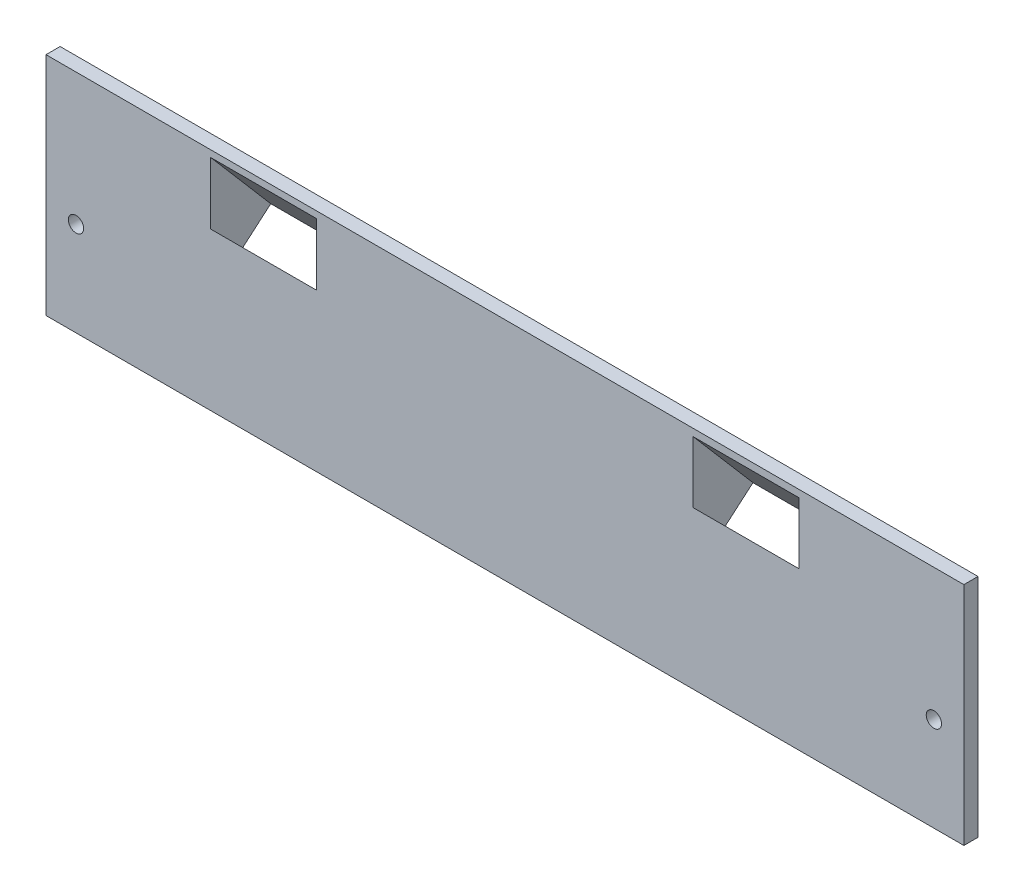
ISO-10303-21;
HEADER;
FILE_DESCRIPTION(('STEP AP214'),'2;1');
FILE_NAME('part.step','',(''),(''),'','','');
FILE_SCHEMA(('AUTOMOTIVE_DESIGN { 1 0 10303 214 1 1 1 1 }'));
ENDSEC;
DATA;
#1=APPLICATION_CONTEXT('core data for automotive mechanical design processes');
#2=APPLICATION_PROTOCOL_DEFINITION('international standard','automotive_design',2000,#1);
#3=PRODUCT_CONTEXT('',#1,'mechanical');
#4=PRODUCT('Part','Part','',(#3));
#5=PRODUCT_RELATED_PRODUCT_CATEGORY('part','',(#4));
#6=PRODUCT_DEFINITION_FORMATION('','',#4);
#7=PRODUCT_DEFINITION_CONTEXT('part definition',#1,'design');
#8=PRODUCT_DEFINITION('design','',#6,#7);
#9=PRODUCT_DEFINITION_SHAPE('','',#8);
#10=(LENGTH_UNIT() NAMED_UNIT(*) SI_UNIT(.MILLI.,.METRE.));
#11=(NAMED_UNIT(*) PLANE_ANGLE_UNIT() SI_UNIT($,.RADIAN.));
#12=(NAMED_UNIT(*) SI_UNIT($,.STERADIAN.) SOLID_ANGLE_UNIT());
#13=UNCERTAINTY_MEASURE_WITH_UNIT(LENGTH_MEASURE(1.E-05),#10,'distance_accuracy_value','');
#14=(GEOMETRIC_REPRESENTATION_CONTEXT(3) GLOBAL_UNCERTAINTY_ASSIGNED_CONTEXT((#13)) GLOBAL_UNIT_ASSIGNED_CONTEXT((#10,
#11,#12)) REPRESENTATION_CONTEXT('',''));
#15=CARTESIAN_POINT('',(0.,0.,0.));
#16=DIRECTION('',(0.,0.,1.));
#17=DIRECTION('',(1.,0.,0.));
#18=AXIS2_PLACEMENT_3D('',#15,#16,#17);
#19=CARTESIAN_POINT('',(0.,0.,0.));
#20=DIRECTION('',(0.,0.,1.));
#21=DIRECTION('',(1.,0.,0.));
#22=AXIS2_PLACEMENT_3D('',#19,#20,#21);
#23=PLANE('',#22);
#24=DIRECTION('',(0.,1.,0.));
#25=VECTOR('',#24,1.);
#26=CARTESIAN_POINT('',(-72.5,39.4998399420699,0.));
#27=LINE('',#26,#25);
#28=CARTESIAN_POINT('',(-72.5,21.0602649226162,0.));
#29=VERTEX_POINT('',#28);
#30=CARTESIAN_POINT('',(-72.5,39.4998399420699,0.));
#31=VERTEX_POINT('',#30);
#32=EDGE_CURVE('E270',#29,#31,#27,.T.);
#33=ORIENTED_EDGE('',*,*,#32,.F.);
#34=DIRECTION('',(-1.,0.,0.));
#35=VECTOR('',#34,1.);
#36=CARTESIAN_POINT('',(-37.5,21.0602649226161,0.));
#37=LINE('',#36,#35);
#38=CARTESIAN_POINT('',(-37.5,21.0602649226161,0.));
#39=VERTEX_POINT('',#38);
#40=EDGE_CURVE('E244',#39,#29,#37,.T.);
#41=ORIENTED_EDGE('',*,*,#40,.F.);
#42=DIRECTION('',(0.,1.,0.));
#43=VECTOR('',#42,1.);
#44=CARTESIAN_POINT('',(-37.5,39.4998399420699,0.));
#45=LINE('',#44,#43);
#46=CARTESIAN_POINT('',(-37.5,39.4998399420699,0.));
#47=VERTEX_POINT('',#46);
#48=EDGE_CURVE('E271',#39,#47,#45,.T.);
#49=ORIENTED_EDGE('',*,*,#48,.T.);
#50=DIRECTION('',(-1.,0.,0.));
#51=VECTOR('',#50,1.);
#52=CARTESIAN_POINT('',(-37.5,39.4998399420699,0.));
#53=LINE('',#52,#51);
#54=EDGE_CURVE('E276',#47,#31,#53,.T.);
#55=ORIENTED_EDGE('',*,*,#54,.T.);
#56=EDGE_LOOP('',(#33,#41,#49,#55));
#57=FACE_BOUND('',#56,.T.);
#58=CARTESIAN_POINT('',(-91.125,15.,0.));
#59=DIRECTION('',(0.,0.,1.));
#60=DIRECTION('',(-1.,0.,0.));
#61=AXIS2_PLACEMENT_3D('',#58,#59,#60);
#62=CIRCLE('',#61,1.625);
#63=CARTESIAN_POINT('',(-92.75,15.,0.));
#64=VERTEX_POINT('',#63);
#65=EDGE_CURVE('E328',#64,#64,#62,.T.);
#66=ORIENTED_EDGE('',*,*,#65,.T.);
#67=EDGE_LOOP('',(#66));
#68=FACE_BOUND('',#67,.T.);
#69=CARTESIAN_POINT('',(91.125,15.,0.));
#70=DIRECTION('',(0.,0.,1.));
#71=DIRECTION('',(1.,0.,0.));
#72=AXIS2_PLACEMENT_3D('',#69,#70,#71);
#73=CIRCLE('',#72,1.625);
#74=CARTESIAN_POINT('',(92.75,15.,0.));
#75=VERTEX_POINT('',#74);
#76=EDGE_CURVE('E332',#75,#75,#73,.T.);
#77=ORIENTED_EDGE('',*,*,#76,.T.);
#78=EDGE_LOOP('',(#77));
#79=FACE_BOUND('',#78,.T.);
#80=DIRECTION('',(0.,1.,0.));
#81=VECTOR('',#80,1.);
#82=CARTESIAN_POINT('',(97.5,0.,0.));
#83=LINE('',#82,#81);
#84=CARTESIAN_POINT('',(97.5,-5.,0.));
#85=VERTEX_POINT('',#84);
#86=CARTESIAN_POINT('',(97.5,43.,0.));
#87=VERTEX_POINT('',#86);
#88=EDGE_CURVE('E338',#85,#87,#83,.T.);
#89=ORIENTED_EDGE('',*,*,#88,.F.);
#90=DIRECTION('',(1.,0.,0.));
#91=VECTOR('',#90,1.);
#92=CARTESIAN_POINT('',(-97.5,-5.,0.));
#93=LINE('',#92,#91);
#94=CARTESIAN_POINT('',(-97.5,-5.,0.));
#95=VERTEX_POINT('',#94);
#96=EDGE_CURVE('E319',#95,#85,#93,.T.);
#97=ORIENTED_EDGE('',*,*,#96,.F.);
#98=DIRECTION('',(0.,-1.,0.));
#99=VECTOR('',#98,1.);
#100=CARTESIAN_POINT('',(-97.5,0.,0.));
#101=LINE('',#100,#99);
#102=CARTESIAN_POINT('',(-97.5,43.,0.));
#103=VERTEX_POINT('',#102);
#104=EDGE_CURVE('E38',#103,#95,#101,.T.);
#105=ORIENTED_EDGE('',*,*,#104,.F.);
#106=DIRECTION('',(-1.,0.,0.));
#107=VECTOR('',#106,1.);
#108=CARTESIAN_POINT('',(-97.5,43.,0.));
#109=LINE('',#108,#107);
#110=EDGE_CURVE('E313',#87,#103,#109,.T.);
#111=ORIENTED_EDGE('',*,*,#110,.F.);
#112=EDGE_LOOP('',(#89,#97,#105,#111));
#113=FACE_BOUND('',#112,.T.);
#114=DIRECTION('',(0.,-1.,0.));
#115=VECTOR('',#114,1.);
#116=CARTESIAN_POINT('',(37.5,39.4998399420699,0.));
#117=LINE('',#116,#115);
#118=CARTESIAN_POINT('',(37.5,39.4998399420699,0.));
#119=VERTEX_POINT('',#118);
#120=CARTESIAN_POINT('',(37.5,21.0602649226161,0.));
#121=VERTEX_POINT('',#120);
#122=EDGE_CURVE('E51',#119,#121,#117,.T.);
#123=ORIENTED_EDGE('',*,*,#122,.T.);
#124=DIRECTION('',(-1.,0.,0.));
#125=VECTOR('',#124,1.);
#126=CARTESIAN_POINT('',(72.5,21.0602649226161,0.));
#127=LINE('',#126,#125);
#128=CARTESIAN_POINT('',(72.5,21.0602649226161,0.));
#129=VERTEX_POINT('',#128);
#130=EDGE_CURVE('E209',#129,#121,#127,.T.);
#131=ORIENTED_EDGE('',*,*,#130,.F.);
#132=DIRECTION('',(0.,-1.,0.));
#133=VECTOR('',#132,1.);
#134=CARTESIAN_POINT('',(72.5,39.4998399420699,0.));
#135=LINE('',#134,#133);
#136=CARTESIAN_POINT('',(72.5,39.4998399420699,0.));
#137=VERTEX_POINT('',#136);
#138=EDGE_CURVE('E59',#137,#129,#135,.T.);
#139=ORIENTED_EDGE('',*,*,#138,.F.);
#140=DIRECTION('',(1.,0.,0.));
#141=VECTOR('',#140,1.);
#142=CARTESIAN_POINT('',(37.5,39.4998399420699,0.));
#143=LINE('',#142,#141);
#144=EDGE_CURVE('E299',#119,#137,#143,.T.);
#145=ORIENTED_EDGE('',*,*,#144,.F.);
#146=EDGE_LOOP('',(#123,#131,#139,#145));
#147=FACE_BOUND('',#146,.T.);
#148=ADVANCED_FACE('F34',(#57,#68,#79,#113,#147),#23,.F.);
#149=CARTESIAN_POINT('',(0.,0.,3.));
#150=DIRECTION('',(0.,0.,1.));
#151=DIRECTION('',(1.,0.,0.));
#152=AXIS2_PLACEMENT_3D('',#149,#150,#151);
#153=PLANE('',#152);
#154=DIRECTION('',(0.,1.,0.));
#155=VECTOR('',#154,1.);
#156=CARTESIAN_POINT('',(-40.,0.,3.));
#157=LINE('',#156,#155);
#158=CARTESIAN_POINT('',(-40.,28.402003109599,3.));
#159=VERTEX_POINT('',#158);
#160=CARTESIAN_POINT('',(-40.,41.5744273875817,3.));
#161=VERTEX_POINT('',#160);
#162=EDGE_CURVE('E268',#159,#161,#157,.T.);
#163=ORIENTED_EDGE('',*,*,#162,.F.);
#164=DIRECTION('',(1.,0.,0.));
#165=VECTOR('',#164,1.);
#166=CARTESIAN_POINT('',(0.,28.402003109599,3.));
#167=LINE('',#166,#165);
#168=CARTESIAN_POINT('',(-62.5,28.402003109599,3.));
#169=VERTEX_POINT('',#168);
#170=EDGE_CURVE('E256',#169,#159,#167,.T.);
#171=ORIENTED_EDGE('',*,*,#170,.F.);
#172=DIRECTION('',(0.,-1.,0.));
#173=VECTOR('',#172,1.);
#174=CARTESIAN_POINT('',(-62.5,0.,3.));
#175=LINE('',#174,#173);
#176=CARTESIAN_POINT('',(-62.5,41.5744273875817,3.));
#177=VERTEX_POINT('',#176);
#178=EDGE_CURVE('E263',#177,#169,#175,.T.);
#179=ORIENTED_EDGE('',*,*,#178,.F.);
#180=DIRECTION('',(-1.,0.,0.));
#181=VECTOR('',#180,1.);
#182=CARTESIAN_POINT('',(0.,41.5744273875817,3.));
#183=LINE('',#182,#181);
#184=EDGE_CURVE('E266',#161,#177,#183,.T.);
#185=ORIENTED_EDGE('',*,*,#184,.F.);
#186=EDGE_LOOP('',(#163,#171,#179,#185));
#187=FACE_BOUND('',#186,.T.);
#188=DIRECTION('',(0.,-1.,0.));
#189=VECTOR('',#188,1.);
#190=CARTESIAN_POINT('',(40.,0.,3.));
#191=LINE('',#190,#189);
#192=CARTESIAN_POINT('',(40.,41.4633687483788,3.));
#193=VERTEX_POINT('',#192);
#194=CARTESIAN_POINT('',(40.,28.4020031095991,3.));
#195=VERTEX_POINT('',#194);
#196=EDGE_CURVE('E293',#193,#195,#191,.T.);
#197=ORIENTED_EDGE('',*,*,#196,.F.);
#198=DIRECTION('',(-1.,0.,0.));
#199=VECTOR('',#198,1.);
#200=CARTESIAN_POINT('',(0.,41.4633687483788,3.));
#201=LINE('',#200,#199);
#202=CARTESIAN_POINT('',(62.5,41.4633687483788,3.));
#203=VERTEX_POINT('',#202);
#204=EDGE_CURVE('E180',#203,#193,#201,.T.);
#205=ORIENTED_EDGE('',*,*,#204,.F.);
#206=DIRECTION('',(0.,1.,0.));
#207=VECTOR('',#206,1.);
#208=CARTESIAN_POINT('',(62.5,0.,3.));
#209=LINE('',#208,#207);
#210=CARTESIAN_POINT('',(62.5,28.4020031095991,3.));
#211=VERTEX_POINT('',#210);
#212=EDGE_CURVE('E288',#211,#203,#209,.T.);
#213=ORIENTED_EDGE('',*,*,#212,.F.);
#214=DIRECTION('',(1.,0.,0.));
#215=VECTOR('',#214,1.);
#216=CARTESIAN_POINT('',(0.,28.4020031095991,3.));
#217=LINE('',#216,#215);
#218=EDGE_CURVE('E291',#195,#211,#217,.T.);
#219=ORIENTED_EDGE('',*,*,#218,.F.);
#220=EDGE_LOOP('',(#197,#205,#213,#219));
#221=FACE_BOUND('',#220,.T.);
#222=CARTESIAN_POINT('',(91.125,15.,3.));
#223=DIRECTION('',(0.,0.,1.));
#224=DIRECTION('',(1.,0.,0.));
#225=AXIS2_PLACEMENT_3D('',#222,#223,#224);
#226=CIRCLE('',#225,1.625);
#227=CARTESIAN_POINT('',(92.75,15.,3.));
#228=VERTEX_POINT('',#227);
#229=EDGE_CURVE('E335',#228,#228,#226,.T.);
#230=ORIENTED_EDGE('',*,*,#229,.F.);
#231=EDGE_LOOP('',(#230));
#232=FACE_BOUND('',#231,.T.);
#233=DIRECTION('',(0.,1.,0.));
#234=VECTOR('',#233,1.);
#235=CARTESIAN_POINT('',(97.5,0.,3.));
#236=LINE('',#235,#234);
#237=CARTESIAN_POINT('',(97.5,-5.,3.));
#238=VERTEX_POINT('',#237);
#239=CARTESIAN_POINT('',(97.5,43.,3.));
#240=VERTEX_POINT('',#239);
#241=EDGE_CURVE('E43',#238,#240,#236,.T.);
#242=ORIENTED_EDGE('',*,*,#241,.T.);
#243=DIRECTION('',(1.,0.,0.));
#244=VECTOR('',#243,1.);
#245=CARTESIAN_POINT('',(-97.5,43.,3.));
#246=LINE('',#245,#244);
#247=CARTESIAN_POINT('',(-97.5,43.,3.));
#248=VERTEX_POINT('',#247);
#249=EDGE_CURVE('E307',#248,#240,#246,.T.);
#250=ORIENTED_EDGE('',*,*,#249,.F.);
#251=DIRECTION('',(0.,-1.,0.));
#252=VECTOR('',#251,1.);
#253=CARTESIAN_POINT('',(-97.5,0.,3.));
#254=LINE('',#253,#252);
#255=CARTESIAN_POINT('',(-97.5,-5.,3.));
#256=VERTEX_POINT('',#255);
#257=EDGE_CURVE('E11',#248,#256,#254,.T.);
#258=ORIENTED_EDGE('',*,*,#257,.T.);
#259=DIRECTION('',(-1.,0.,0.));
#260=VECTOR('',#259,1.);
#261=CARTESIAN_POINT('',(-97.5,-5.,3.));
#262=LINE('',#261,#260);
#263=EDGE_CURVE('E325',#238,#256,#262,.T.);
#264=ORIENTED_EDGE('',*,*,#263,.F.);
#265=EDGE_LOOP('',(#242,#250,#258,#264));
#266=FACE_BOUND('',#265,.T.);
#267=CARTESIAN_POINT('',(-91.125,15.,3.));
#268=DIRECTION('',(0.,0.,1.));
#269=DIRECTION('',(-1.,0.,0.));
#270=AXIS2_PLACEMENT_3D('',#267,#268,#269);
#271=CIRCLE('',#270,1.625);
#272=CARTESIAN_POINT('',(-92.75,15.,3.));
#273=VERTEX_POINT('',#272);
#274=EDGE_CURVE('E329',#273,#273,#271,.T.);
#275=ORIENTED_EDGE('',*,*,#274,.F.);
#276=EDGE_LOOP('',(#275));
#277=FACE_BOUND('',#276,.T.);
#278=ADVANCED_FACE('F355',(#187,#221,#232,#266,#277),#153,.T.);
#279=CARTESIAN_POINT('',(97.5,0.,3.));
#280=DIRECTION('',(-1.,0.,0.));
#281=DIRECTION('',(0.,0.,1.));
#282=AXIS2_PLACEMENT_3D('',#279,#280,#281);
#283=PLANE('',#282);
#284=ORIENTED_EDGE('',*,*,#88,.T.);
#285=DIRECTION('',(0.,0.,-1.));
#286=VECTOR('',#285,1.);
#287=CARTESIAN_POINT('',(97.5,43.,0.));
#288=LINE('',#287,#286);
#289=EDGE_CURVE('E310',#240,#87,#288,.T.);
#290=ORIENTED_EDGE('',*,*,#289,.F.);
#291=ORIENTED_EDGE('',*,*,#241,.F.);
#292=DIRECTION('',(0.,0.,1.));
#293=VECTOR('',#292,1.);
#294=CARTESIAN_POINT('',(97.5,-5.,3.));
#295=LINE('',#294,#293);
#296=EDGE_CURVE('E322',#85,#238,#295,.T.);
#297=ORIENTED_EDGE('',*,*,#296,.F.);
#298=EDGE_LOOP('',(#284,#290,#291,#297));
#299=FACE_BOUND('',#298,.T.);
#300=ADVANCED_FACE('F36',(#299),#283,.F.);
#301=CARTESIAN_POINT('',(-97.5,0.,3.));
#302=DIRECTION('',(1.,0.,0.));
#303=DIRECTION('',(0.,0.,-1.));
#304=AXIS2_PLACEMENT_3D('',#301,#302,#303);
#305=PLANE('',#304);
#306=ORIENTED_EDGE('',*,*,#104,.T.);
#307=DIRECTION('',(0.,0.,-1.));
#308=VECTOR('',#307,1.);
#309=CARTESIAN_POINT('',(-97.5,-5.,3.));
#310=LINE('',#309,#308);
#311=EDGE_CURVE('E316',#256,#95,#310,.T.);
#312=ORIENTED_EDGE('',*,*,#311,.F.);
#313=ORIENTED_EDGE('',*,*,#257,.F.);
#314=DIRECTION('',(0.,0.,1.));
#315=VECTOR('',#314,1.);
#316=CARTESIAN_POINT('',(-97.5,43.,0.));
#317=LINE('',#316,#315);
#318=EDGE_CURVE('E304',#103,#248,#317,.T.);
#319=ORIENTED_EDGE('',*,*,#318,.F.);
#320=EDGE_LOOP('',(#306,#312,#313,#319));
#321=FACE_BOUND('',#320,.T.);
#322=ADVANCED_FACE('F348',(#321),#305,.F.);
#323=CARTESIAN_POINT('',(91.125,15.,3.));
#324=DIRECTION('',(0.,0.,-1.));
#325=DIRECTION('',(-1.,0.,0.));
#326=AXIS2_PLACEMENT_3D('',#323,#324,#325);
#327=CYLINDRICAL_SURFACE('',#326,1.625);
#328=ORIENTED_EDGE('',*,*,#229,.T.);
#329=EDGE_LOOP('',(#328));
#330=FACE_BOUND('',#329,.T.);
#331=ORIENTED_EDGE('',*,*,#76,.F.);
#332=EDGE_LOOP('',(#331));
#333=FACE_BOUND('',#332,.T.);
#334=ADVANCED_FACE('F365',(#330,#333),#327,.F.);
#335=CARTESIAN_POINT('',(-91.125,15.,3.));
#336=DIRECTION('',(0.,0.,-1.));
#337=DIRECTION('',(-1.,0.,0.));
#338=AXIS2_PLACEMENT_3D('',#335,#336,#337);
#339=CYLINDRICAL_SURFACE('',#338,1.625);
#340=ORIENTED_EDGE('',*,*,#274,.T.);
#341=EDGE_LOOP('',(#340));
#342=FACE_BOUND('',#341,.T.);
#343=ORIENTED_EDGE('',*,*,#65,.F.);
#344=EDGE_LOOP('',(#343));
#345=FACE_BOUND('',#344,.T.);
#346=ADVANCED_FACE('F377',(#342,#345),#339,.F.);
#347=CARTESIAN_POINT('',(0.,-5.,0.));
#348=DIRECTION('',(0.,-1.,0.));
#349=DIRECTION('',(0.,0.,-1.));
#350=AXIS2_PLACEMENT_3D('',#347,#348,#349);
#351=PLANE('',#350);
#352=ORIENTED_EDGE('',*,*,#311,.T.);
#353=ORIENTED_EDGE('',*,*,#96,.T.);
#354=ORIENTED_EDGE('',*,*,#296,.T.);
#355=ORIENTED_EDGE('',*,*,#263,.T.);
#356=EDGE_LOOP('',(#352,#353,#354,#355));
#357=FACE_BOUND('',#356,.T.);
#358=ADVANCED_FACE('F352',(#357),#351,.T.);
#359=CARTESIAN_POINT('',(0.,43.,0.));
#360=DIRECTION('',(0.,1.,0.));
#361=DIRECTION('',(0.,0.,1.));
#362=AXIS2_PLACEMENT_3D('',#359,#360,#361);
#363=PLANE('',#362);
#364=ORIENTED_EDGE('',*,*,#318,.T.);
#365=ORIENTED_EDGE('',*,*,#249,.T.);
#366=ORIENTED_EDGE('',*,*,#289,.T.);
#367=ORIENTED_EDGE('',*,*,#110,.T.);
#368=EDGE_LOOP('',(#364,#365,#366,#367));
#369=FACE_BOUND('',#368,.T.);
#370=ADVANCED_FACE('F359',(#369),#363,.T.);
#371=CARTESIAN_POINT('',(37.5,39.4998399420699,0.));
#372=DIRECTION('',(0.,0.650774217265853,-0.759271307334879));
#373=DIRECTION('',(0.,0.759271307334879,0.650774217265853));
#374=AXIS2_PLACEMENT_3D('',#371,#372,#373);
#375=PLANE('',#374);
#376=DIRECTION('',(0.,0.759271307334879,0.650774217265853));
#377=VECTOR('',#376,1.);
#378=CARTESIAN_POINT('',(72.5,39.4998399420699,0.));
#379=LINE('',#378,#377);
#380=CARTESIAN_POINT('',(72.5,27.3078663630393,-10.4497851903156));
#381=VERTEX_POINT('',#380);
#382=EDGE_CURVE('E295',#381,#137,#379,.T.);
#383=ORIENTED_EDGE('',*,*,#382,.F.);
#384=DIRECTION('',(1.,0.,0.));
#385=VECTOR('',#384,1.);
#386=CARTESIAN_POINT('',(37.5,27.3078663630393,-10.4497851903156));
#387=LINE('',#386,#385);
#388=CARTESIAN_POINT('',(37.5,27.3078663630393,-10.4497851903156));
#389=VERTEX_POINT('',#388);
#390=EDGE_CURVE('E729',#389,#381,#387,.T.);
#391=ORIENTED_EDGE('',*,*,#390,.F.);
#392=DIRECTION('',(0.,0.759271307334879,0.650774217265853));
#393=VECTOR('',#392,1.);
#394=CARTESIAN_POINT('',(37.5,39.4998399420699,0.));
#395=LINE('',#394,#393);
#396=EDGE_CURVE('E296',#389,#119,#395,.T.);
#397=ORIENTED_EDGE('',*,*,#396,.T.);
#398=ORIENTED_EDGE('',*,*,#144,.T.);
#399=EDGE_LOOP('',(#383,#391,#397,#398));
#400=FACE_BOUND('',#399,.T.);
#401=ADVANCED_FACE('F386',(#400),#375,.T.);
#402=CARTESIAN_POINT('',(37.5,0.,0.));
#403=DIRECTION('',(1.,0.,0.));
#404=DIRECTION('',(0.,0.,-1.));
#405=AXIS2_PLACEMENT_3D('',#402,#403,#404);
#406=PLANE('',#405);
#407=ORIENTED_EDGE('',*,*,#396,.F.);
#408=DIRECTION('',(0.,0.650774217265853,-0.759271307334879));
#409=VECTOR('',#408,1.);
#410=CARTESIAN_POINT('',(37.5,19.4985757558491,-1.33852950229707));
#411=LINE('',#410,#409);
#412=CARTESIAN_POINT('',(37.5,19.4985757558491,-1.33852950229707));
#413=VERTEX_POINT('',#412);
#414=EDGE_CURVE('E204',#413,#389,#411,.T.);
#415=ORIENTED_EDGE('',*,*,#414,.F.);
#416=DIRECTION('',(0.,-0.759271307334879,-0.650774217265853));
#417=VECTOR('',#416,1.);
#418=CARTESIAN_POINT('',(37.5,62.0062466716785,35.0949508634276));
#419=LINE('',#418,#417);
#420=EDGE_CURVE('E212',#121,#413,#419,.T.);
#421=ORIENTED_EDGE('',*,*,#420,.F.);
#422=ORIENTED_EDGE('',*,*,#122,.F.);
#423=EDGE_LOOP('',(#407,#415,#421,#422));
#424=FACE_BOUND('',#423,.T.);
#425=ADVANCED_FACE('F389',(#424),#406,.F.);
#426=CARTESIAN_POINT('',(72.5,0.,0.));
#427=DIRECTION('',(1.,0.,0.));
#428=DIRECTION('',(0.,0.,-1.));
#429=AXIS2_PLACEMENT_3D('',#426,#427,#428);
#430=PLANE('',#429);
#431=ORIENTED_EDGE('',*,*,#138,.T.);
#432=DIRECTION('',(0.,-0.759271307334879,-0.650774217265853));
#433=VECTOR('',#432,1.);
#434=CARTESIAN_POINT('',(72.5,62.0062466716785,35.0949508634276));
#435=LINE('',#434,#433);
#436=CARTESIAN_POINT('',(72.5,19.4985757558491,-1.33852950229707));
#437=VERTEX_POINT('',#436);
#438=EDGE_CURVE('E195',#129,#437,#435,.T.);
#439=ORIENTED_EDGE('',*,*,#438,.T.);
#440=DIRECTION('',(0.,-0.650774217265853,0.759271307334879));
#441=VECTOR('',#440,1.);
#442=CARTESIAN_POINT('',(72.5,27.3078663630393,-10.4497851903156));
#443=LINE('',#442,#441);
#444=EDGE_CURVE('E725',#381,#437,#443,.T.);
#445=ORIENTED_EDGE('',*,*,#444,.F.);
#446=ORIENTED_EDGE('',*,*,#382,.T.);
#447=EDGE_LOOP('',(#431,#439,#445,#446));
#448=FACE_BOUND('',#447,.T.);
#449=ADVANCED_FACE('F391',(#448),#430,.T.);
#450=CARTESIAN_POINT('',(40.,36.8176449359744,10.2130774196813));
#451=DIRECTION('',(-1.,0.,0.));
#452=DIRECTION('',(0.,0.,1.));
#453=AXIS2_PLACEMENT_3D('',#450,#451,#452);
#454=PLANE('',#453);
#455=DIRECTION('',(0.,-0.75927130733488,-0.650774217265852));
#456=VECTOR('',#455,1.);
#457=CARTESIAN_POINT('',(40.,36.8176449359744,10.2130774196813));
#458=LINE('',#457,#456);
#459=CARTESIAN_POINT('',(40.,21.1255112990137,-3.23670777063428));
#460=VERTEX_POINT('',#459);
#461=EDGE_CURVE('E190',#195,#460,#458,.T.);
#462=ORIENTED_EDGE('',*,*,#461,.T.);
#463=DIRECTION('',(0.,0.650774217265853,-0.759271307334879));
#464=VECTOR('',#463,1.);
#465=CARTESIAN_POINT('',(40.,21.1255112990137,-3.23670777063428));
#466=LINE('',#465,#464);
#467=CARTESIAN_POINT('',(40.,26.6570921457735,-9.69051388298075));
#468=VERTEX_POINT('',#467);
#469=EDGE_CURVE('E187',#460,#468,#466,.T.);
#470=ORIENTED_EDGE('',*,*,#469,.T.);
#471=DIRECTION('',(0.,-0.75927130733488,-0.650774217265852));
#472=VECTOR('',#471,1.);
#473=CARTESIAN_POINT('',(40.,42.3492257827341,3.75927130733487));
#474=LINE('',#473,#472);
#475=EDGE_CURVE('E173',#193,#468,#474,.T.);
#476=ORIENTED_EDGE('',*,*,#475,.F.);
#477=ORIENTED_EDGE('',*,*,#196,.T.);
#478=EDGE_LOOP('',(#462,#470,#476,#477));
#479=FACE_BOUND('',#478,.T.);
#480=ADVANCED_FACE('F188',(#479),#454,.F.);
#481=CARTESIAN_POINT('',(62.5,36.8176449359744,10.2130774196813));
#482=DIRECTION('',(0.,-0.650774217265852,0.75927130733488));
#483=DIRECTION('',(0.,-0.75927130733488,-0.650774217265852));
#484=AXIS2_PLACEMENT_3D('',#481,#482,#483);
#485=PLANE('',#484);
#486=DIRECTION('',(0.,-0.75927130733488,-0.650774217265852));
#487=VECTOR('',#486,1.);
#488=CARTESIAN_POINT('',(62.5,36.8176449359744,10.2130774196813));
#489=LINE('',#488,#487);
#490=CARTESIAN_POINT('',(62.5,21.1255112990137,-3.23670777063428));
#491=VERTEX_POINT('',#490);
#492=EDGE_CURVE('E284',#211,#491,#489,.T.);
#493=ORIENTED_EDGE('',*,*,#492,.T.);
#494=DIRECTION('',(-1.,0.,0.));
#495=VECTOR('',#494,1.);
#496=CARTESIAN_POINT('',(40.,21.1255112990137,-3.23670777063428));
#497=LINE('',#496,#495);
#498=EDGE_CURVE('E194',#491,#460,#497,.T.);
#499=ORIENTED_EDGE('',*,*,#498,.T.);
#500=ORIENTED_EDGE('',*,*,#461,.F.);
#501=ORIENTED_EDGE('',*,*,#218,.T.);
#502=EDGE_LOOP('',(#493,#499,#500,#501));
#503=FACE_BOUND('',#502,.T.);
#504=ADVANCED_FACE('F399',(#503),#485,.F.);
#505=CARTESIAN_POINT('',(62.5,42.3492257827341,3.75927130733487));
#506=DIRECTION('',(1.,0.,0.));
#507=DIRECTION('',(0.,0.,-1.));
#508=AXIS2_PLACEMENT_3D('',#505,#506,#507);
#509=PLANE('',#508);
#510=DIRECTION('',(0.,-0.75927130733488,-0.650774217265852));
#511=VECTOR('',#510,1.);
#512=CARTESIAN_POINT('',(62.5,42.3492257827341,3.75927130733487));
#513=LINE('',#512,#511);
#514=CARTESIAN_POINT('',(62.5,26.6570921457735,-9.69051388298076));
#515=VERTEX_POINT('',#514);
#516=EDGE_CURVE('E183',#203,#515,#513,.T.);
#517=ORIENTED_EDGE('',*,*,#516,.T.);
#518=DIRECTION('',(0.,-0.650774217265853,0.759271307334879));
#519=VECTOR('',#518,1.);
#520=CARTESIAN_POINT('',(62.5,21.1255112990137,-3.23670777063428));
#521=LINE('',#520,#519);
#522=EDGE_CURVE('E200',#515,#491,#521,.T.);
#523=ORIENTED_EDGE('',*,*,#522,.T.);
#524=ORIENTED_EDGE('',*,*,#492,.F.);
#525=ORIENTED_EDGE('',*,*,#212,.T.);
#526=EDGE_LOOP('',(#517,#523,#524,#525));
#527=FACE_BOUND('',#526,.T.);
#528=ADVANCED_FACE('F403',(#527),#509,.F.);
#529=CARTESIAN_POINT('',(40.,42.3492257827341,3.75927130733487));
#530=DIRECTION('',(0.,0.650774217265852,-0.75927130733488));
#531=DIRECTION('',(0.,0.75927130733488,0.650774217265852));
#532=AXIS2_PLACEMENT_3D('',#529,#530,#531);
#533=PLANE('',#532);
#534=ORIENTED_EDGE('',*,*,#475,.T.);
#535=DIRECTION('',(1.,0.,0.));
#536=VECTOR('',#535,1.);
#537=CARTESIAN_POINT('',(40.,26.6570921457735,-9.69051388298076));
#538=LINE('',#537,#536);
#539=EDGE_CURVE('E177',#468,#515,#538,.T.);
#540=ORIENTED_EDGE('',*,*,#539,.T.);
#541=ORIENTED_EDGE('',*,*,#516,.F.);
#542=ORIENTED_EDGE('',*,*,#204,.T.);
#543=EDGE_LOOP('',(#534,#540,#541,#542));
#544=FACE_BOUND('',#543,.T.);
#545=ADVANCED_FACE('F175',(#544),#533,.F.);
#546=CARTESIAN_POINT('',(-37.5,30.3449515923788,-7.84668832125221));
#547=DIRECTION('',(0.,0.650774217265853,-0.759271307334879));
#548=DIRECTION('',(0.,0.759271307334879,0.650774217265853));
#549=AXIS2_PLACEMENT_3D('',#546,#547,#548);
#550=PLANE('',#549);
#551=DIRECTION('',(0.,-0.759271307334879,-0.650774217265853));
#552=VECTOR('',#551,1.);
#553=CARTESIAN_POINT('',(-72.5,30.3449515923788,-7.84668832125221));
#554=LINE('',#553,#552);
#555=CARTESIAN_POINT('',(-72.5,27.3078663630393,-10.4497851903156));
#556=VERTEX_POINT('',#555);
#557=EDGE_CURVE('E274',#31,#556,#554,.T.);
#558=ORIENTED_EDGE('',*,*,#557,.F.);
#559=ORIENTED_EDGE('',*,*,#54,.F.);
#560=DIRECTION('',(0.,-0.759271307334879,-0.650774217265853));
#561=VECTOR('',#560,1.);
#562=CARTESIAN_POINT('',(-37.5,30.3449515923788,-7.84668832125221));
#563=LINE('',#562,#561);
#564=CARTESIAN_POINT('',(-37.5,27.3078663630393,-10.4497851903156));
#565=VERTEX_POINT('',#564);
#566=EDGE_CURVE('E273',#47,#565,#563,.T.);
#567=ORIENTED_EDGE('',*,*,#566,.T.);
#568=DIRECTION('',(1.,0.,0.));
#569=VECTOR('',#568,1.);
#570=CARTESIAN_POINT('',(-72.5,27.3078663630393,-10.4497851903156));
#571=LINE('',#570,#569);
#572=EDGE_CURVE('E222',#556,#565,#571,.T.);
#573=ORIENTED_EDGE('',*,*,#572,.F.);
#574=EDGE_LOOP('',(#558,#559,#567,#573));
#575=FACE_BOUND('',#574,.T.);
#576=ADVANCED_FACE('F402',(#575),#550,.T.);
#577=CARTESIAN_POINT('',(-37.5,0.,0.));
#578=DIRECTION('',(1.,0.,0.));
#579=DIRECTION('',(0.,0.,-1.));
#580=AXIS2_PLACEMENT_3D('',#577,#578,#579);
#581=PLANE('',#580);
#582=ORIENTED_EDGE('',*,*,#48,.F.);
#583=DIRECTION('',(0.,-0.759271307334879,-0.650774217265853));
#584=VECTOR('',#583,1.);
#585=CARTESIAN_POINT('',(-37.5,62.0062466716785,35.0949508634276));
#586=LINE('',#585,#584);
#587=CARTESIAN_POINT('',(-37.5,19.4985757558491,-1.33852950229708));
#588=VERTEX_POINT('',#587);
#589=EDGE_CURVE('E241',#39,#588,#586,.T.);
#590=ORIENTED_EDGE('',*,*,#589,.T.);
#591=DIRECTION('',(0.,-0.650774217265853,0.759271307334879));
#592=VECTOR('',#591,1.);
#593=CARTESIAN_POINT('',(-37.5,27.3078663630393,-10.4497851903156));
#594=LINE('',#593,#592);
#595=EDGE_CURVE('E219',#565,#588,#594,.T.);
#596=ORIENTED_EDGE('',*,*,#595,.F.);
#597=ORIENTED_EDGE('',*,*,#566,.F.);
#598=EDGE_LOOP('',(#582,#590,#596,#597));
#599=FACE_BOUND('',#598,.T.);
#600=ADVANCED_FACE('F420',(#599),#581,.T.);
#601=CARTESIAN_POINT('',(-72.5,0.,0.));
#602=DIRECTION('',(1.,0.,0.));
#603=DIRECTION('',(0.,0.,-1.));
#604=AXIS2_PLACEMENT_3D('',#601,#602,#603);
#605=PLANE('',#604);
#606=ORIENTED_EDGE('',*,*,#32,.T.);
#607=ORIENTED_EDGE('',*,*,#557,.T.);
#608=DIRECTION('',(0.,0.650774217265853,-0.759271307334879));
#609=VECTOR('',#608,1.);
#610=CARTESIAN_POINT('',(-72.5,19.4985757558491,-1.33852950229708));
#611=LINE('',#610,#609);
#612=CARTESIAN_POINT('',(-72.5,19.4985757558491,-1.33852950229708));
#613=VERTEX_POINT('',#612);
#614=EDGE_CURVE('E225',#613,#556,#611,.T.);
#615=ORIENTED_EDGE('',*,*,#614,.F.);
#616=DIRECTION('',(0.,-0.759271307334879,-0.650774217265853));
#617=VECTOR('',#616,1.);
#618=CARTESIAN_POINT('',(-72.5,62.0062466716785,35.0949508634276));
#619=LINE('',#618,#617);
#620=EDGE_CURVE('E247',#29,#613,#619,.T.);
#621=ORIENTED_EDGE('',*,*,#620,.F.);
#622=EDGE_LOOP('',(#606,#607,#615,#621));
#623=FACE_BOUND('',#622,.T.);
#624=ADVANCED_FACE('F422',(#623),#605,.F.);
#625=CARTESIAN_POINT('',(-40.,36.8176449359744,10.2130774196814));
#626=DIRECTION('',(1.,0.,0.));
#627=DIRECTION('',(0.,0.,-1.));
#628=AXIS2_PLACEMENT_3D('',#625,#626,#627);
#629=PLANE('',#628);
#630=DIRECTION('',(0.,-0.759271307334879,-0.650774217265853));
#631=VECTOR('',#630,1.);
#632=CARTESIAN_POINT('',(-40.,42.396259902938,3.70439565770233));
#633=LINE('',#632,#631);
#634=CARTESIAN_POINT('',(-40.,26.7041262659774,-9.74538953261332));
#635=VERTEX_POINT('',#634);
#636=EDGE_CURVE('E254',#161,#635,#633,.T.);
#637=ORIENTED_EDGE('',*,*,#636,.T.);
#638=DIRECTION('',(0.,-0.650774217265853,0.759271307334879));
#639=VECTOR('',#638,1.);
#640=CARTESIAN_POINT('',(-40.,21.1255112990137,-3.23670777063427));
#641=LINE('',#640,#639);
#642=CARTESIAN_POINT('',(-40.,21.1255112990137,-3.23670777063427));
#643=VERTEX_POINT('',#642);
#644=EDGE_CURVE('E232',#635,#643,#641,.T.);
#645=ORIENTED_EDGE('',*,*,#644,.T.);
#646=DIRECTION('',(0.,-0.759271307334879,-0.650774217265853));
#647=VECTOR('',#646,1.);
#648=CARTESIAN_POINT('',(-40.,36.8176449359744,10.2130774196814));
#649=LINE('',#648,#647);
#650=EDGE_CURVE('E253',#159,#643,#649,.T.);
#651=ORIENTED_EDGE('',*,*,#650,.F.);
#652=ORIENTED_EDGE('',*,*,#162,.T.);
#653=EDGE_LOOP('',(#637,#645,#651,#652));
#654=FACE_BOUND('',#653,.T.);
#655=ADVANCED_FACE('F425',(#654),#629,.F.);
#656=CARTESIAN_POINT('',(-40.,42.396259902938,3.70439565770233));
#657=DIRECTION('',(0.,0.650774217265853,-0.759271307334879));
#658=DIRECTION('',(0.,0.759271307334879,0.650774217265853));
#659=AXIS2_PLACEMENT_3D('',#656,#657,#658);
#660=PLANE('',#659);
#661=DIRECTION('',(0.,-0.759271307334879,-0.650774217265853));
#662=VECTOR('',#661,1.);
#663=CARTESIAN_POINT('',(-62.5,42.3962599029381,3.70439565770232));
#664=LINE('',#663,#662);
#665=CARTESIAN_POINT('',(-62.5,26.7041262659774,-9.74538953261332));
#666=VERTEX_POINT('',#665);
#667=EDGE_CURVE('E257',#177,#666,#664,.T.);
#668=ORIENTED_EDGE('',*,*,#667,.T.);
#669=DIRECTION('',(1.,0.,0.));
#670=VECTOR('',#669,1.);
#671=CARTESIAN_POINT('',(-62.5,26.7041262659774,-9.74538953261332));
#672=LINE('',#671,#670);
#673=EDGE_CURVE('E236',#666,#635,#672,.T.);
#674=ORIENTED_EDGE('',*,*,#673,.T.);
#675=ORIENTED_EDGE('',*,*,#636,.F.);
#676=ORIENTED_EDGE('',*,*,#184,.T.);
#677=EDGE_LOOP('',(#668,#674,#675,#676));
#678=FACE_BOUND('',#677,.T.);
#679=ADVANCED_FACE('F432',(#678),#660,.F.);
#680=CARTESIAN_POINT('',(-62.5,36.8176449359744,10.2130774196814));
#681=DIRECTION('',(-1.,0.,0.));
#682=DIRECTION('',(0.,0.,1.));
#683=AXIS2_PLACEMENT_3D('',#680,#681,#682);
#684=PLANE('',#683);
#685=DIRECTION('',(0.,-0.759271307334879,-0.650774217265853));
#686=VECTOR('',#685,1.);
#687=CARTESIAN_POINT('',(-62.5,36.8176449359744,10.2130774196814));
#688=LINE('',#687,#686);
#689=CARTESIAN_POINT('',(-62.5,21.1255112990137,-3.23670777063427));
#690=VERTEX_POINT('',#689);
#691=EDGE_CURVE('E259',#169,#690,#688,.T.);
#692=ORIENTED_EDGE('',*,*,#691,.T.);
#693=DIRECTION('',(0.,0.650774217265853,-0.759271307334879));
#694=VECTOR('',#693,1.);
#695=CARTESIAN_POINT('',(-62.5,21.1255112990137,-3.23670777063427));
#696=LINE('',#695,#694);
#697=EDGE_CURVE('E233',#690,#666,#696,.T.);
#698=ORIENTED_EDGE('',*,*,#697,.T.);
#699=ORIENTED_EDGE('',*,*,#667,.F.);
#700=ORIENTED_EDGE('',*,*,#178,.T.);
#701=EDGE_LOOP('',(#692,#698,#699,#700));
#702=FACE_BOUND('',#701,.T.);
#703=ADVANCED_FACE('F438',(#702),#684,.F.);
#704=CARTESIAN_POINT('',(-40.,36.8176449359744,10.2130774196814));
#705=DIRECTION('',(0.,-0.650774217265853,0.759271307334879));
#706=DIRECTION('',(0.,-0.759271307334879,-0.650774217265853));
#707=AXIS2_PLACEMENT_3D('',#704,#705,#706);
#708=PLANE('',#707);
#709=ORIENTED_EDGE('',*,*,#650,.T.);
#710=DIRECTION('',(-1.,0.,0.));
#711=VECTOR('',#710,1.);
#712=CARTESIAN_POINT('',(-62.5,21.1255112990137,-3.23670777063427));
#713=LINE('',#712,#711);
#714=EDGE_CURVE('E229',#643,#690,#713,.T.);
#715=ORIENTED_EDGE('',*,*,#714,.T.);
#716=ORIENTED_EDGE('',*,*,#691,.F.);
#717=ORIENTED_EDGE('',*,*,#170,.T.);
#718=EDGE_LOOP('',(#709,#715,#716,#717));
#719=FACE_BOUND('',#718,.T.);
#720=ADVANCED_FACE('F434',(#719),#708,.F.);
#721=CARTESIAN_POINT('',(-37.5,62.0062466716785,35.0949508634276));
#722=DIRECTION('',(0.,-0.650774217265853,0.759271307334879));
#723=DIRECTION('',(0.,-0.759271307334879,-0.650774217265853));
#724=AXIS2_PLACEMENT_3D('',#721,#722,#723);
#725=PLANE('',#724);
#726=ORIENTED_EDGE('',*,*,#589,.F.);
#727=ORIENTED_EDGE('',*,*,#40,.T.);
#728=ORIENTED_EDGE('',*,*,#620,.T.);
#729=DIRECTION('',(-1.,0.,0.));
#730=VECTOR('',#729,1.);
#731=CARTESIAN_POINT('',(-37.5,19.4985757558491,-1.33852950229708));
#732=LINE('',#731,#730);
#733=EDGE_CURVE('E215',#588,#613,#732,.T.);
#734=ORIENTED_EDGE('',*,*,#733,.F.);
#735=EDGE_LOOP('',(#726,#727,#728,#734));
#736=FACE_BOUND('',#735,.T.);
#737=ADVANCED_FACE('F437',(#736),#725,.T.);
#738=CARTESIAN_POINT('',(0.,10.5794044153158,9.06764625635921));
#739=DIRECTION('',(0.,-0.759271307334879,-0.650774217265853));
#740=DIRECTION('',(0.,0.650774217265853,-0.759271307334879));
#741=AXIS2_PLACEMENT_3D('',#738,#739,#740);
#742=PLANE('',#741);
#743=CARTESIAN_POINT('',(-66.25,23.7286081680772,-6.27379299997386));
#744=DIRECTION('',(0.,-0.759271307334879,-0.650774217265853));
#745=DIRECTION('',(0.,0.650774217265853,-0.759271307334879));
#746=AXIS2_PLACEMENT_3D('',#743,#744,#745);
#747=CIRCLE('',#746,0.999999999999984);
#748=CARTESIAN_POINT('',(-66.25,24.379382385343,-7.03306430730873));
#749=VERTEX_POINT('',#748);
#750=EDGE_CURVE('E228',#749,#749,#747,.T.);
#751=ORIENTED_EDGE('',*,*,#750,.F.);
#752=EDGE_LOOP('',(#751));
#753=FACE_BOUND('',#752,.T.);
#754=ORIENTED_EDGE('',*,*,#697,.F.);
#755=ORIENTED_EDGE('',*,*,#714,.F.);
#756=ORIENTED_EDGE('',*,*,#644,.F.);
#757=ORIENTED_EDGE('',*,*,#673,.F.);
#758=EDGE_LOOP('',(#754,#755,#756,#757));
#759=FACE_BOUND('',#758,.T.);
#760=ORIENTED_EDGE('',*,*,#614,.T.);
#761=ORIENTED_EDGE('',*,*,#572,.T.);
#762=ORIENTED_EDGE('',*,*,#595,.T.);
#763=ORIENTED_EDGE('',*,*,#733,.T.);
#764=EDGE_LOOP('',(#760,#761,#762,#763));
#765=FACE_BOUND('',#764,.T.);
#766=ADVANCED_FACE('F454',(#753,#759,#765),#742,.T.);
#767=CARTESIAN_POINT('',(-66.25,30.5620499340911,-0.416825044581174));
#768=DIRECTION('',(0.,0.759271307334879,0.650774217265853));
#769=DIRECTION('',(0.,-0.650774217265853,0.759271307334879));
#770=AXIS2_PLACEMENT_3D('',#767,#768,#769);
#771=PLANE('',#770);
#772=CARTESIAN_POINT('',(-66.25,30.5620499340911,-0.416825044581174));
#773=DIRECTION('',(0.,-0.759271307334879,-0.650774217265853));
#774=DIRECTION('',(0.,-0.650774217265853,0.759271307334879));
#775=AXIS2_PLACEMENT_3D('',#772,#773,#774);
#776=CIRCLE('',#775,0.999999999999984);
#777=CARTESIAN_POINT('',(-66.25,29.9112757168252,0.342446262753693));
#778=VERTEX_POINT('',#777);
#779=EDGE_CURVE('E218',#778,#778,#776,.T.);
#780=ORIENTED_EDGE('',*,*,#779,.T.);
#781=EDGE_LOOP('',(#780));
#782=FACE_BOUND('',#781,.T.);
#783=ADVANCED_FACE('F450',(#782),#771,.F.);
#784=CARTESIAN_POINT('',(-66.25,30.5620499340911,-0.416825044581174));
#785=DIRECTION('',(0.,-0.759271307334879,-0.650774217265853));
#786=DIRECTION('',(0.,0.650774217265853,-0.759271307334879));
#787=AXIS2_PLACEMENT_3D('',#784,#785,#786);
#788=CYLINDRICAL_SURFACE('',#787,0.999999999999984);
#789=ORIENTED_EDGE('',*,*,#779,.F.);
#790=EDGE_LOOP('',(#789));
#791=FACE_BOUND('',#790,.T.);
#792=ORIENTED_EDGE('',*,*,#750,.T.);
#793=EDGE_LOOP('',(#792));
#794=FACE_BOUND('',#793,.T.);
#795=ADVANCED_FACE('F446',(#791,#794),#788,.F.);
#796=CARTESIAN_POINT('',(72.5,62.0062466716785,35.0949508634276));
#797=DIRECTION('',(0.,-0.650774217265853,0.759271307334879));
#798=DIRECTION('',(0.,-0.759271307334879,-0.650774217265853));
#799=AXIS2_PLACEMENT_3D('',#796,#797,#798);
#800=PLANE('',#799);
#801=ORIENTED_EDGE('',*,*,#438,.F.);
#802=ORIENTED_EDGE('',*,*,#130,.T.);
#803=ORIENTED_EDGE('',*,*,#420,.T.);
#804=DIRECTION('',(-1.,0.,0.));
#805=VECTOR('',#804,1.);
#806=CARTESIAN_POINT('',(72.5,19.4985757558491,-1.33852950229707));
#807=LINE('',#806,#805);
#808=EDGE_CURVE('E248',#437,#413,#807,.T.);
#809=ORIENTED_EDGE('',*,*,#808,.F.);
#810=EDGE_LOOP('',(#801,#802,#803,#809));
#811=FACE_BOUND('',#810,.T.);
#812=ADVANCED_FACE('F449',(#811),#800,.T.);
#813=CARTESIAN_POINT('',(0.,10.5794044153158,9.06764625635922));
#814=DIRECTION('',(0.,-0.759271307334879,-0.650774217265853));
#815=DIRECTION('',(0.,0.650774217265853,-0.759271307334879));
#816=AXIS2_PLACEMENT_3D('',#813,#814,#815);
#817=PLANE('',#816);
#818=CARTESIAN_POINT('',(66.25,23.7286081680771,-6.2737929999738));
#819=DIRECTION('',(0.,-0.759271307334879,-0.650774217265853));
#820=DIRECTION('',(0.,0.650774217265853,-0.759271307334879));
#821=AXIS2_PLACEMENT_3D('',#818,#819,#820);
#822=CIRCLE('',#821,0.999999999999998);
#823=CARTESIAN_POINT('',(66.25,24.379382385343,-7.03306430730868));
#824=VERTEX_POINT('',#823);
#825=EDGE_CURVE('E201',#824,#824,#822,.T.);
#826=ORIENTED_EDGE('',*,*,#825,.F.);
#827=EDGE_LOOP('',(#826));
#828=FACE_BOUND('',#827,.T.);
#829=ORIENTED_EDGE('',*,*,#469,.F.);
#830=ORIENTED_EDGE('',*,*,#498,.F.);
#831=ORIENTED_EDGE('',*,*,#522,.F.);
#832=ORIENTED_EDGE('',*,*,#539,.F.);
#833=EDGE_LOOP('',(#829,#830,#831,#832));
#834=FACE_BOUND('',#833,.T.);
#835=ORIENTED_EDGE('',*,*,#414,.T.);
#836=ORIENTED_EDGE('',*,*,#390,.T.);
#837=ORIENTED_EDGE('',*,*,#444,.T.);
#838=ORIENTED_EDGE('',*,*,#808,.T.);
#839=EDGE_LOOP('',(#835,#836,#837,#838));
#840=FACE_BOUND('',#839,.T.);
#841=ADVANCED_FACE('F197',(#828,#834,#840),#817,.T.);
#842=CARTESIAN_POINT('',(66.25,30.562049934091,-0.41682504458112));
#843=DIRECTION('',(0.,-0.759271307334879,-0.650774217265853));
#844=DIRECTION('',(0.,0.650774217265853,-0.759271307334879));
#845=AXIS2_PLACEMENT_3D('',#842,#843,#844);
#846=PLANE('',#845);
#847=CARTESIAN_POINT('',(66.25,30.562049934091,-0.41682504458112));
#848=DIRECTION('',(0.,-0.759271307334879,-0.650774217265853));
#849=DIRECTION('',(0.,0.650774217265853,-0.759271307334879));
#850=AXIS2_PLACEMENT_3D('',#847,#848,#849);
#851=CIRCLE('',#850,0.999999999999998);
#852=CARTESIAN_POINT('',(66.25,31.2128241513569,-1.176096351916));
#853=VERTEX_POINT('',#852);
#854=EDGE_CURVE('E184',#853,#853,#851,.T.);
#855=ORIENTED_EDGE('',*,*,#854,.T.);
#856=EDGE_LOOP('',(#855));
#857=FACE_BOUND('',#856,.T.);
#858=ADVANCED_FACE('F413',(#857),#846,.T.);
#859=CARTESIAN_POINT('',(66.25,30.562049934091,-0.41682504458112));
#860=DIRECTION('',(0.,-0.759271307334879,-0.650774217265853));
#861=DIRECTION('',(0.,0.650774217265853,-0.759271307334879));
#862=AXIS2_PLACEMENT_3D('',#859,#860,#861);
#863=CYLINDRICAL_SURFACE('',#862,0.999999999999998);
#864=ORIENTED_EDGE('',*,*,#854,.F.);
#865=EDGE_LOOP('',(#864));
#866=FACE_BOUND('',#865,.T.);
#867=ORIENTED_EDGE('',*,*,#825,.T.);
#868=EDGE_LOOP('',(#867));
#869=FACE_BOUND('',#868,.T.);
#870=ADVANCED_FACE('F410',(#866,#869),#863,.F.);
#871=CLOSED_SHELL('',(#148,#278,#300,#322,#334,#346,#358,#370,#401,#425,#449,#480,#504,#528,
#545,#576,#600,#624,#655,#679,#703,#720,#737,#766,#783,#795,#812,#841,#858,#870));
#872=MANIFOLD_SOLID_BREP('B2',#871);
#873=ADVANCED_BREP_SHAPE_REPRESENTATION('',(#18,#872),#14);
#874=SHAPE_DEFINITION_REPRESENTATION(#9,#873);
ENDSEC;
END-ISO-10303-21;
